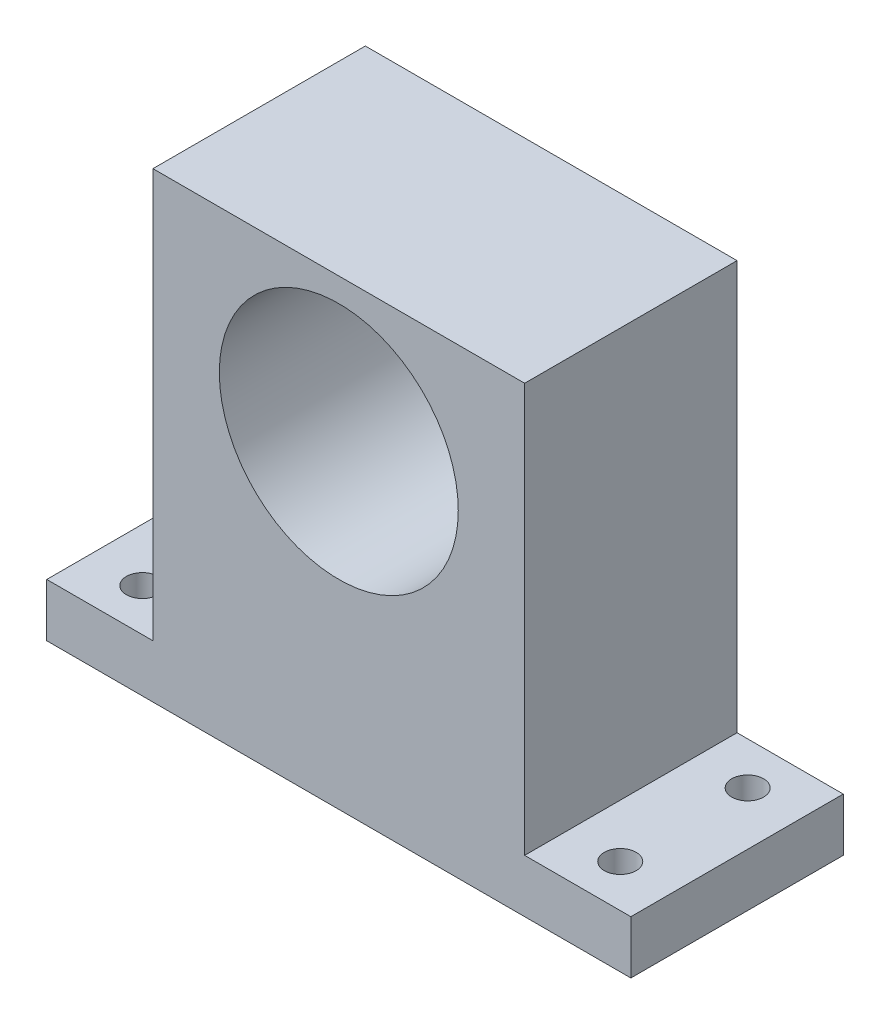
ISO-10303-21;
HEADER;
FILE_DESCRIPTION(('STEP AP214'),'2;1');
FILE_NAME('part.step','',(''),(''),'','','');
FILE_SCHEMA(('AUTOMOTIVE_DESIGN { 1 0 10303 214 1 1 1 1 }'));
ENDSEC;
DATA;
#1=APPLICATION_CONTEXT('core data for automotive mechanical design processes');
#2=APPLICATION_PROTOCOL_DEFINITION('international standard','automotive_design',2000,#1);
#3=PRODUCT_CONTEXT('',#1,'mechanical');
#4=PRODUCT('Part','Part','',(#3));
#5=PRODUCT_RELATED_PRODUCT_CATEGORY('part','',(#4));
#6=PRODUCT_DEFINITION_FORMATION('','',#4);
#7=PRODUCT_DEFINITION_CONTEXT('part definition',#1,'design');
#8=PRODUCT_DEFINITION('design','',#6,#7);
#9=PRODUCT_DEFINITION_SHAPE('','',#8);
#10=(LENGTH_UNIT() NAMED_UNIT(*) SI_UNIT(.MILLI.,.METRE.));
#11=(NAMED_UNIT(*) PLANE_ANGLE_UNIT() SI_UNIT($,.RADIAN.));
#12=(NAMED_UNIT(*) SI_UNIT($,.STERADIAN.) SOLID_ANGLE_UNIT());
#13=UNCERTAINTY_MEASURE_WITH_UNIT(LENGTH_MEASURE(1.E-05),#10,'distance_accuracy_value','');
#14=(GEOMETRIC_REPRESENTATION_CONTEXT(3) GLOBAL_UNCERTAINTY_ASSIGNED_CONTEXT((#13)) GLOBAL_UNIT_ASSIGNED_CONTEXT((#10,
#11,#12)) REPRESENTATION_CONTEXT('',''));
#15=CARTESIAN_POINT('',(0.,0.,0.));
#16=DIRECTION('',(0.,0.,1.));
#17=DIRECTION('',(1.,0.,0.));
#18=AXIS2_PLACEMENT_3D('',#15,#16,#17);
#19=CARTESIAN_POINT('',(-17.5,-21.75,20.));
#20=DIRECTION('',(1.,0.,0.));
#21=DIRECTION('',(0.,0.,-1.));
#22=AXIS2_PLACEMENT_3D('',#19,#20,#21);
#23=PLANE('',#22);
#24=DIRECTION('',(0.,0.,-1.));
#25=VECTOR('',#24,1.);
#26=CARTESIAN_POINT('',(-17.5,-16.75,0.));
#27=LINE('',#26,#25);
#28=CARTESIAN_POINT('',(-17.5,-16.75,20.));
#29=VERTEX_POINT('',#28);
#30=CARTESIAN_POINT('',(-17.5,-16.75,0.));
#31=VERTEX_POINT('',#30);
#32=EDGE_CURVE('E48',#29,#31,#27,.T.);
#33=ORIENTED_EDGE('',*,*,#32,.F.);
#34=DIRECTION('',(0.,-1.,0.));
#35=VECTOR('',#34,1.);
#36=CARTESIAN_POINT('',(-17.5,-21.75,20.));
#37=LINE('',#36,#35);
#38=CARTESIAN_POINT('',(-17.5,21.75,20.));
#39=VERTEX_POINT('',#38);
#40=EDGE_CURVE('E158',#39,#29,#37,.T.);
#41=ORIENTED_EDGE('',*,*,#40,.F.);
#42=DIRECTION('',(0.,0.,-1.));
#43=VECTOR('',#42,1.);
#44=CARTESIAN_POINT('',(-17.5,21.75,20.));
#45=LINE('',#44,#43);
#46=CARTESIAN_POINT('',(-17.5,21.75,0.));
#47=VERTEX_POINT('',#46);
#48=EDGE_CURVE('E41',#39,#47,#45,.T.);
#49=ORIENTED_EDGE('',*,*,#48,.T.);
#50=DIRECTION('',(0.,-1.,0.));
#51=VECTOR('',#50,1.);
#52=CARTESIAN_POINT('',(-17.5,-21.75,0.));
#53=LINE('',#52,#51);
#54=EDGE_CURVE('E111',#47,#31,#53,.T.);
#55=ORIENTED_EDGE('',*,*,#54,.T.);
#56=EDGE_LOOP('',(#33,#41,#49,#55));
#57=FACE_BOUND('',#56,.T.);
#58=ADVANCED_FACE('F33',(#57),#23,.F.);
#59=CARTESIAN_POINT('',(17.5,-21.75,20.));
#60=DIRECTION('',(-1.,0.,0.));
#61=DIRECTION('',(0.,0.,1.));
#62=AXIS2_PLACEMENT_3D('',#59,#60,#61);
#63=PLANE('',#62);
#64=DIRECTION('',(0.,0.,1.));
#65=VECTOR('',#64,1.);
#66=CARTESIAN_POINT('',(17.5,-16.75,20.));
#67=LINE('',#66,#65);
#68=CARTESIAN_POINT('',(17.5,-16.75,0.));
#69=VERTEX_POINT('',#68);
#70=CARTESIAN_POINT('',(17.5,-16.75,20.));
#71=VERTEX_POINT('',#70);
#72=EDGE_CURVE('E56',#69,#71,#67,.T.);
#73=ORIENTED_EDGE('',*,*,#72,.F.);
#74=DIRECTION('',(0.,1.,0.));
#75=VECTOR('',#74,1.);
#76=CARTESIAN_POINT('',(17.5,-21.75,0.));
#77=LINE('',#76,#75);
#78=CARTESIAN_POINT('',(17.5,21.75,0.));
#79=VERTEX_POINT('',#78);
#80=EDGE_CURVE('E154',#69,#79,#77,.T.);
#81=ORIENTED_EDGE('',*,*,#80,.T.);
#82=DIRECTION('',(0.,0.,-1.));
#83=VECTOR('',#82,1.);
#84=CARTESIAN_POINT('',(17.5,21.75,20.));
#85=LINE('',#84,#83);
#86=CARTESIAN_POINT('',(17.5,21.75,20.));
#87=VERTEX_POINT('',#86);
#88=EDGE_CURVE('E11',#87,#79,#85,.T.);
#89=ORIENTED_EDGE('',*,*,#88,.F.);
#90=DIRECTION('',(0.,1.,0.));
#91=VECTOR('',#90,1.);
#92=CARTESIAN_POINT('',(17.5,-21.75,20.));
#93=LINE('',#92,#91);
#94=EDGE_CURVE('E110',#71,#87,#93,.T.);
#95=ORIENTED_EDGE('',*,*,#94,.F.);
#96=EDGE_LOOP('',(#73,#81,#89,#95));
#97=FACE_BOUND('',#96,.T.);
#98=ADVANCED_FACE('F35',(#97),#63,.F.);
#99=CARTESIAN_POINT('',(-17.5,21.75,20.));
#100=DIRECTION('',(0.,-1.,0.));
#101=DIRECTION('',(0.,0.,-1.));
#102=AXIS2_PLACEMENT_3D('',#99,#100,#101);
#103=PLANE('',#102);
#104=DIRECTION('',(-1.,0.,0.));
#105=VECTOR('',#104,1.);
#106=CARTESIAN_POINT('',(-17.5,21.75,0.));
#107=LINE('',#106,#105);
#108=EDGE_CURVE('E162',#79,#47,#107,.T.);
#109=ORIENTED_EDGE('',*,*,#108,.T.);
#110=ORIENTED_EDGE('',*,*,#48,.F.);
#111=DIRECTION('',(-1.,0.,0.));
#112=VECTOR('',#111,1.);
#113=CARTESIAN_POINT('',(-17.5,21.75,20.));
#114=LINE('',#113,#112);
#115=EDGE_CURVE('E156',#87,#39,#114,.T.);
#116=ORIENTED_EDGE('',*,*,#115,.F.);
#117=ORIENTED_EDGE('',*,*,#88,.T.);
#118=EDGE_LOOP('',(#109,#110,#116,#117));
#119=FACE_BOUND('',#118,.T.);
#120=ADVANCED_FACE('F176',(#119),#103,.F.);
#121=CARTESIAN_POINT('',(-17.5,-21.75,20.));
#122=DIRECTION('',(0.,1.,0.));
#123=DIRECTION('',(0.,0.,1.));
#124=AXIS2_PLACEMENT_3D('',#121,#122,#123);
#125=PLANE('',#124);
#126=CARTESIAN_POINT('',(-22.5,-21.75,4.));
#127=DIRECTION('',(0.,1.,0.));
#128=DIRECTION('',(0.,0.,1.));
#129=AXIS2_PLACEMENT_3D('',#126,#127,#128);
#130=CIRCLE('',#129,1.5);
#131=CARTESIAN_POINT('',(-22.5,-21.75,5.5));
#132=VERTEX_POINT('',#131);
#133=EDGE_CURVE('E214',#132,#132,#130,.T.);
#134=ORIENTED_EDGE('',*,*,#133,.T.);
#135=EDGE_LOOP('',(#134));
#136=FACE_BOUND('',#135,.T.);
#137=CARTESIAN_POINT('',(22.5,-21.75,16.));
#138=DIRECTION('',(0.,1.,0.));
#139=DIRECTION('',(0.,0.,1.));
#140=AXIS2_PLACEMENT_3D('',#137,#138,#139);
#141=CIRCLE('',#140,1.5);
#142=CARTESIAN_POINT('',(22.5,-21.75,17.5));
#143=VERTEX_POINT('',#142);
#144=EDGE_CURVE('E218',#143,#143,#141,.T.);
#145=ORIENTED_EDGE('',*,*,#144,.T.);
#146=EDGE_LOOP('',(#145));
#147=FACE_BOUND('',#146,.T.);
#148=CARTESIAN_POINT('',(22.5,-21.75,4.));
#149=DIRECTION('',(0.,1.,0.));
#150=DIRECTION('',(0.,0.,1.));
#151=AXIS2_PLACEMENT_3D('',#148,#149,#150);
#152=CIRCLE('',#151,1.5);
#153=CARTESIAN_POINT('',(22.5,-21.75,5.5));
#154=VERTEX_POINT('',#153);
#155=EDGE_CURVE('E222',#154,#154,#152,.T.);
#156=ORIENTED_EDGE('',*,*,#155,.T.);
#157=EDGE_LOOP('',(#156));
#158=FACE_BOUND('',#157,.T.);
#159=CARTESIAN_POINT('',(-22.5,-21.75,16.));
#160=DIRECTION('',(0.,1.,0.));
#161=DIRECTION('',(0.,0.,1.));
#162=AXIS2_PLACEMENT_3D('',#159,#160,#161);
#163=CIRCLE('',#162,1.5);
#164=CARTESIAN_POINT('',(-22.5,-21.75,17.5));
#165=VERTEX_POINT('',#164);
#166=EDGE_CURVE('E126',#165,#165,#163,.T.);
#167=ORIENTED_EDGE('',*,*,#166,.T.);
#168=EDGE_LOOP('',(#167));
#169=FACE_BOUND('',#168,.T.);
#170=DIRECTION('',(1.,0.,0.));
#171=VECTOR('',#170,1.);
#172=CARTESIAN_POINT('',(-17.5,-21.75,0.));
#173=LINE('',#172,#171);
#174=CARTESIAN_POINT('',(-27.5,-21.75,0.));
#175=VERTEX_POINT('',#174);
#176=CARTESIAN_POINT('',(27.5,-21.75,0.));
#177=VERTEX_POINT('',#176);
#178=EDGE_CURVE('E99',#175,#177,#173,.T.);
#179=ORIENTED_EDGE('',*,*,#178,.T.);
#180=DIRECTION('',(0.,0.,-1.));
#181=VECTOR('',#180,1.);
#182=CARTESIAN_POINT('',(27.5,-21.75,20.));
#183=LINE('',#182,#181);
#184=CARTESIAN_POINT('',(27.5,-21.75,20.));
#185=VERTEX_POINT('',#184);
#186=EDGE_CURVE('E142',#185,#177,#183,.T.);
#187=ORIENTED_EDGE('',*,*,#186,.F.);
#188=DIRECTION('',(1.,0.,0.));
#189=VECTOR('',#188,1.);
#190=CARTESIAN_POINT('',(-17.5,-21.75,20.));
#191=LINE('',#190,#189);
#192=CARTESIAN_POINT('',(-27.5,-21.75,20.));
#193=VERTEX_POINT('',#192);
#194=EDGE_CURVE('E116',#193,#185,#191,.T.);
#195=ORIENTED_EDGE('',*,*,#194,.F.);
#196=DIRECTION('',(0.,0.,1.));
#197=VECTOR('',#196,1.);
#198=CARTESIAN_POINT('',(-27.5,-21.75,0.));
#199=LINE('',#198,#197);
#200=EDGE_CURVE('E114',#175,#193,#199,.T.);
#201=ORIENTED_EDGE('',*,*,#200,.F.);
#202=EDGE_LOOP('',(#179,#187,#195,#201));
#203=FACE_BOUND('',#202,.T.);
#204=ADVANCED_FACE('F115',(#136,#147,#158,#169,#203),#125,.F.);
#205=CARTESIAN_POINT('',(0.,0.,20.));
#206=DIRECTION('',(0.,0.,-1.));
#207=DIRECTION('',(-1.,0.,0.));
#208=AXIS2_PLACEMENT_3D('',#205,#206,#207);
#209=PLANE('',#208);
#210=CARTESIAN_POINT('',(0.,8.25,20.));
#211=DIRECTION('',(0.,0.,-1.));
#212=DIRECTION('',(-1.,0.,0.));
#213=AXIS2_PLACEMENT_3D('',#210,#211,#212);
#214=CIRCLE('',#213,11.25);
#215=CARTESIAN_POINT('',(-11.25,8.25,20.));
#216=VERTEX_POINT('',#215);
#217=EDGE_CURVE('E239',#216,#216,#214,.T.);
#218=ORIENTED_EDGE('',*,*,#217,.T.);
#219=EDGE_LOOP('',(#218));
#220=FACE_BOUND('',#219,.T.);
#221=ORIENTED_EDGE('',*,*,#194,.T.);
#222=DIRECTION('',(0.,-1.,0.));
#223=VECTOR('',#222,1.);
#224=CARTESIAN_POINT('',(27.5,-21.75,20.));
#225=LINE('',#224,#223);
#226=CARTESIAN_POINT('',(27.5,-16.75,20.));
#227=VERTEX_POINT('',#226);
#228=EDGE_CURVE('E139',#227,#185,#225,.T.);
#229=ORIENTED_EDGE('',*,*,#228,.F.);
#230=DIRECTION('',(-1.,0.,0.));
#231=VECTOR('',#230,1.);
#232=CARTESIAN_POINT('',(27.5,-16.75,20.));
#233=LINE('',#232,#231);
#234=EDGE_CURVE('E147',#227,#71,#233,.T.);
#235=ORIENTED_EDGE('',*,*,#234,.T.);
#236=ORIENTED_EDGE('',*,*,#94,.T.);
#237=ORIENTED_EDGE('',*,*,#115,.T.);
#238=ORIENTED_EDGE('',*,*,#40,.T.);
#239=DIRECTION('',(1.,0.,0.));
#240=VECTOR('',#239,1.);
#241=CARTESIAN_POINT('',(-27.5,-16.75,20.));
#242=LINE('',#241,#240);
#243=CARTESIAN_POINT('',(-27.5,-16.75,20.));
#244=VERTEX_POINT('',#243);
#245=EDGE_CURVE('E136',#244,#29,#242,.T.);
#246=ORIENTED_EDGE('',*,*,#245,.F.);
#247=DIRECTION('',(0.,1.,0.));
#248=VECTOR('',#247,1.);
#249=CARTESIAN_POINT('',(-27.5,-21.75,20.));
#250=LINE('',#249,#248);
#251=EDGE_CURVE('E119',#193,#244,#250,.T.);
#252=ORIENTED_EDGE('',*,*,#251,.F.);
#253=EDGE_LOOP('',(#221,#229,#235,#236,#237,#238,#246,#252));
#254=FACE_BOUND('',#253,.T.);
#255=ADVANCED_FACE('F174',(#220,#254),#209,.F.);
#256=CARTESIAN_POINT('',(0.,0.,0.));
#257=DIRECTION('',(0.,0.,-1.));
#258=DIRECTION('',(-1.,0.,0.));
#259=AXIS2_PLACEMENT_3D('',#256,#257,#258);
#260=PLANE('',#259);
#261=CARTESIAN_POINT('',(0.,8.25,0.));
#262=DIRECTION('',(0.,0.,-1.));
#263=DIRECTION('',(-1.,0.,0.));
#264=AXIS2_PLACEMENT_3D('',#261,#262,#263);
#265=CIRCLE('',#264,11.25);
#266=CARTESIAN_POINT('',(-11.25,8.25,0.));
#267=VERTEX_POINT('',#266);
#268=EDGE_CURVE('E241',#267,#267,#265,.T.);
#269=ORIENTED_EDGE('',*,*,#268,.F.);
#270=EDGE_LOOP('',(#269));
#271=FACE_BOUND('',#270,.T.);
#272=ORIENTED_EDGE('',*,*,#80,.F.);
#273=DIRECTION('',(-1.,0.,0.));
#274=VECTOR('',#273,1.);
#275=CARTESIAN_POINT('',(27.5,-16.75,0.));
#276=LINE('',#275,#274);
#277=CARTESIAN_POINT('',(27.5,-16.75,0.));
#278=VERTEX_POINT('',#277);
#279=EDGE_CURVE('E151',#278,#69,#276,.T.);
#280=ORIENTED_EDGE('',*,*,#279,.F.);
#281=DIRECTION('',(0.,1.,0.));
#282=VECTOR('',#281,1.);
#283=CARTESIAN_POINT('',(27.5,-21.75,0.));
#284=LINE('',#283,#282);
#285=EDGE_CURVE('E106',#177,#278,#284,.T.);
#286=ORIENTED_EDGE('',*,*,#285,.F.);
#287=ORIENTED_EDGE('',*,*,#178,.F.);
#288=DIRECTION('',(0.,-1.,0.));
#289=VECTOR('',#288,1.);
#290=CARTESIAN_POINT('',(-27.5,-21.75,0.));
#291=LINE('',#290,#289);
#292=CARTESIAN_POINT('',(-27.5,-16.75,0.));
#293=VERTEX_POINT('',#292);
#294=EDGE_CURVE('E104',#293,#175,#291,.T.);
#295=ORIENTED_EDGE('',*,*,#294,.F.);
#296=DIRECTION('',(1.,0.,0.));
#297=VECTOR('',#296,1.);
#298=CARTESIAN_POINT('',(-27.5,-16.75,0.));
#299=LINE('',#298,#297);
#300=EDGE_CURVE('E133',#293,#31,#299,.T.);
#301=ORIENTED_EDGE('',*,*,#300,.T.);
#302=ORIENTED_EDGE('',*,*,#54,.F.);
#303=ORIENTED_EDGE('',*,*,#108,.F.);
#304=EDGE_LOOP('',(#272,#280,#286,#287,#295,#301,#302,#303));
#305=FACE_BOUND('',#304,.T.);
#306=ADVANCED_FACE('F101',(#271,#305),#260,.T.);
#307=CARTESIAN_POINT('',(27.5,-16.75,20.));
#308=DIRECTION('',(0.,-1.,0.));
#309=DIRECTION('',(0.,0.,-1.));
#310=AXIS2_PLACEMENT_3D('',#307,#308,#309);
#311=PLANE('',#310);
#312=CARTESIAN_POINT('',(22.5,-16.75,16.));
#313=DIRECTION('',(0.,1.,0.));
#314=DIRECTION('',(0.,0.,1.));
#315=AXIS2_PLACEMENT_3D('',#312,#313,#314);
#316=CIRCLE('',#315,1.5);
#317=CARTESIAN_POINT('',(22.5,-16.75,17.5));
#318=VERTEX_POINT('',#317);
#319=EDGE_CURVE('E228',#318,#318,#316,.T.);
#320=ORIENTED_EDGE('',*,*,#319,.F.);
#321=EDGE_LOOP('',(#320));
#322=FACE_BOUND('',#321,.T.);
#323=CARTESIAN_POINT('',(22.5,-16.75,4.));
#324=DIRECTION('',(0.,1.,0.));
#325=DIRECTION('',(0.,0.,1.));
#326=AXIS2_PLACEMENT_3D('',#323,#324,#325);
#327=CIRCLE('',#326,1.5);
#328=CARTESIAN_POINT('',(22.5,-16.75,5.5));
#329=VERTEX_POINT('',#328);
#330=EDGE_CURVE('E236',#329,#329,#327,.T.);
#331=ORIENTED_EDGE('',*,*,#330,.F.);
#332=EDGE_LOOP('',(#331));
#333=FACE_BOUND('',#332,.T.);
#334=ORIENTED_EDGE('',*,*,#72,.T.);
#335=ORIENTED_EDGE('',*,*,#234,.F.);
#336=DIRECTION('',(0.,0.,1.));
#337=VECTOR('',#336,1.);
#338=CARTESIAN_POINT('',(27.5,-16.75,20.));
#339=LINE('',#338,#337);
#340=EDGE_CURVE('E145',#278,#227,#339,.T.);
#341=ORIENTED_EDGE('',*,*,#340,.F.);
#342=ORIENTED_EDGE('',*,*,#279,.T.);
#343=EDGE_LOOP('',(#334,#335,#341,#342));
#344=FACE_BOUND('',#343,.T.);
#345=ADVANCED_FACE('F179',(#322,#333,#344),#311,.F.);
#346=CARTESIAN_POINT('',(27.5,0.,0.));
#347=DIRECTION('',(-1.,0.,0.));
#348=DIRECTION('',(0.,0.,1.));
#349=AXIS2_PLACEMENT_3D('',#346,#347,#348);
#350=PLANE('',#349);
#351=ORIENTED_EDGE('',*,*,#228,.T.);
#352=ORIENTED_EDGE('',*,*,#186,.T.);
#353=ORIENTED_EDGE('',*,*,#285,.T.);
#354=ORIENTED_EDGE('',*,*,#340,.T.);
#355=EDGE_LOOP('',(#351,#352,#353,#354));
#356=FACE_BOUND('',#355,.T.);
#357=ADVANCED_FACE('F183',(#356),#350,.F.);
#358=CARTESIAN_POINT('',(-27.5,-16.75,0.));
#359=DIRECTION('',(0.,-1.,0.));
#360=DIRECTION('',(0.,0.,-1.));
#361=AXIS2_PLACEMENT_3D('',#358,#359,#360);
#362=PLANE('',#361);
#363=CARTESIAN_POINT('',(-22.5,-16.75,4.));
#364=DIRECTION('',(0.,1.,0.));
#365=DIRECTION('',(0.,0.,1.));
#366=AXIS2_PLACEMENT_3D('',#363,#364,#365);
#367=CIRCLE('',#366,1.5);
#368=CARTESIAN_POINT('',(-22.5,-16.75,5.5));
#369=VERTEX_POINT('',#368);
#370=EDGE_CURVE('E232',#369,#369,#367,.T.);
#371=ORIENTED_EDGE('',*,*,#370,.F.);
#372=EDGE_LOOP('',(#371));
#373=FACE_BOUND('',#372,.T.);
#374=CARTESIAN_POINT('',(-22.5,-16.75,16.));
#375=DIRECTION('',(0.,1.,0.));
#376=DIRECTION('',(0.,0.,1.));
#377=AXIS2_PLACEMENT_3D('',#374,#375,#376);
#378=CIRCLE('',#377,1.5);
#379=CARTESIAN_POINT('',(-22.5,-16.75,17.5));
#380=VERTEX_POINT('',#379);
#381=EDGE_CURVE('E129',#380,#380,#378,.T.);
#382=ORIENTED_EDGE('',*,*,#381,.F.);
#383=EDGE_LOOP('',(#382));
#384=FACE_BOUND('',#383,.T.);
#385=ORIENTED_EDGE('',*,*,#32,.T.);
#386=ORIENTED_EDGE('',*,*,#300,.F.);
#387=DIRECTION('',(0.,0.,-1.));
#388=VECTOR('',#387,1.);
#389=CARTESIAN_POINT('',(-27.5,-16.75,0.));
#390=LINE('',#389,#388);
#391=EDGE_CURVE('E123',#244,#293,#390,.T.);
#392=ORIENTED_EDGE('',*,*,#391,.F.);
#393=ORIENTED_EDGE('',*,*,#245,.T.);
#394=EDGE_LOOP('',(#385,#386,#392,#393));
#395=FACE_BOUND('',#394,.T.);
#396=ADVANCED_FACE('F171',(#373,#384,#395),#362,.F.);
#397=CARTESIAN_POINT('',(-27.5,0.,0.));
#398=DIRECTION('',(1.,0.,0.));
#399=DIRECTION('',(0.,0.,-1.));
#400=AXIS2_PLACEMENT_3D('',#397,#398,#399);
#401=PLANE('',#400);
#402=ORIENTED_EDGE('',*,*,#294,.T.);
#403=ORIENTED_EDGE('',*,*,#200,.T.);
#404=ORIENTED_EDGE('',*,*,#251,.T.);
#405=ORIENTED_EDGE('',*,*,#391,.T.);
#406=EDGE_LOOP('',(#402,#403,#404,#405));
#407=FACE_BOUND('',#406,.T.);
#408=ADVANCED_FACE('F121',(#407),#401,.F.);
#409=CARTESIAN_POINT('',(-22.5,-21.75,16.));
#410=DIRECTION('',(0.,1.,0.));
#411=DIRECTION('',(0.,0.,1.));
#412=AXIS2_PLACEMENT_3D('',#409,#410,#411);
#413=CYLINDRICAL_SURFACE('',#412,1.5);
#414=ORIENTED_EDGE('',*,*,#166,.F.);
#415=EDGE_LOOP('',(#414));
#416=FACE_BOUND('',#415,.T.);
#417=ORIENTED_EDGE('',*,*,#381,.T.);
#418=EDGE_LOOP('',(#417));
#419=FACE_BOUND('',#418,.T.);
#420=ADVANCED_FACE('F282',(#416,#419),#413,.F.);
#421=CARTESIAN_POINT('',(-22.5,-21.75,4.));
#422=DIRECTION('',(0.,1.,0.));
#423=DIRECTION('',(0.,0.,1.));
#424=AXIS2_PLACEMENT_3D('',#421,#422,#423);
#425=CYLINDRICAL_SURFACE('',#424,1.5);
#426=ORIENTED_EDGE('',*,*,#133,.F.);
#427=EDGE_LOOP('',(#426));
#428=FACE_BOUND('',#427,.T.);
#429=ORIENTED_EDGE('',*,*,#370,.T.);
#430=EDGE_LOOP('',(#429));
#431=FACE_BOUND('',#430,.T.);
#432=ADVANCED_FACE('F287',(#428,#431),#425,.F.);
#433=CARTESIAN_POINT('',(22.5,-21.75,4.));
#434=DIRECTION('',(0.,1.,0.));
#435=DIRECTION('',(0.,0.,1.));
#436=AXIS2_PLACEMENT_3D('',#433,#434,#435);
#437=CYLINDRICAL_SURFACE('',#436,1.5);
#438=ORIENTED_EDGE('',*,*,#155,.F.);
#439=EDGE_LOOP('',(#438));
#440=FACE_BOUND('',#439,.T.);
#441=ORIENTED_EDGE('',*,*,#330,.T.);
#442=EDGE_LOOP('',(#441));
#443=FACE_BOUND('',#442,.T.);
#444=ADVANCED_FACE('F296',(#440,#443),#437,.F.);
#445=CARTESIAN_POINT('',(22.5,-21.75,16.));
#446=DIRECTION('',(0.,1.,0.));
#447=DIRECTION('',(0.,0.,1.));
#448=AXIS2_PLACEMENT_3D('',#445,#446,#447);
#449=CYLINDRICAL_SURFACE('',#448,1.5);
#450=ORIENTED_EDGE('',*,*,#144,.F.);
#451=EDGE_LOOP('',(#450));
#452=FACE_BOUND('',#451,.T.);
#453=ORIENTED_EDGE('',*,*,#319,.T.);
#454=EDGE_LOOP('',(#453));
#455=FACE_BOUND('',#454,.T.);
#456=ADVANCED_FACE('F250',(#452,#455),#449,.F.);
#457=CARTESIAN_POINT('',(0.,8.25,20.));
#458=DIRECTION('',(0.,0.,-1.));
#459=DIRECTION('',(-1.,0.,0.));
#460=AXIS2_PLACEMENT_3D('',#457,#458,#459);
#461=CYLINDRICAL_SURFACE('',#460,11.25);
#462=ORIENTED_EDGE('',*,*,#217,.F.);
#463=EDGE_LOOP('',(#462));
#464=FACE_BOUND('',#463,.T.);
#465=ORIENTED_EDGE('',*,*,#268,.T.);
#466=EDGE_LOOP('',(#465));
#467=FACE_BOUND('',#466,.T.);
#468=ADVANCED_FACE('F247',(#464,#467),#461,.F.);
#469=CLOSED_SHELL('',(#58,#98,#120,#204,#255,#306,#345,#357,#396,#408,#420,#432,#444,#456,#468));
#470=MANIFOLD_SOLID_BREP('B2',#469);
#471=ADVANCED_BREP_SHAPE_REPRESENTATION('',(#18,#470),#14);
#472=SHAPE_DEFINITION_REPRESENTATION(#9,#471);
ENDSEC;
END-ISO-10303-21;
